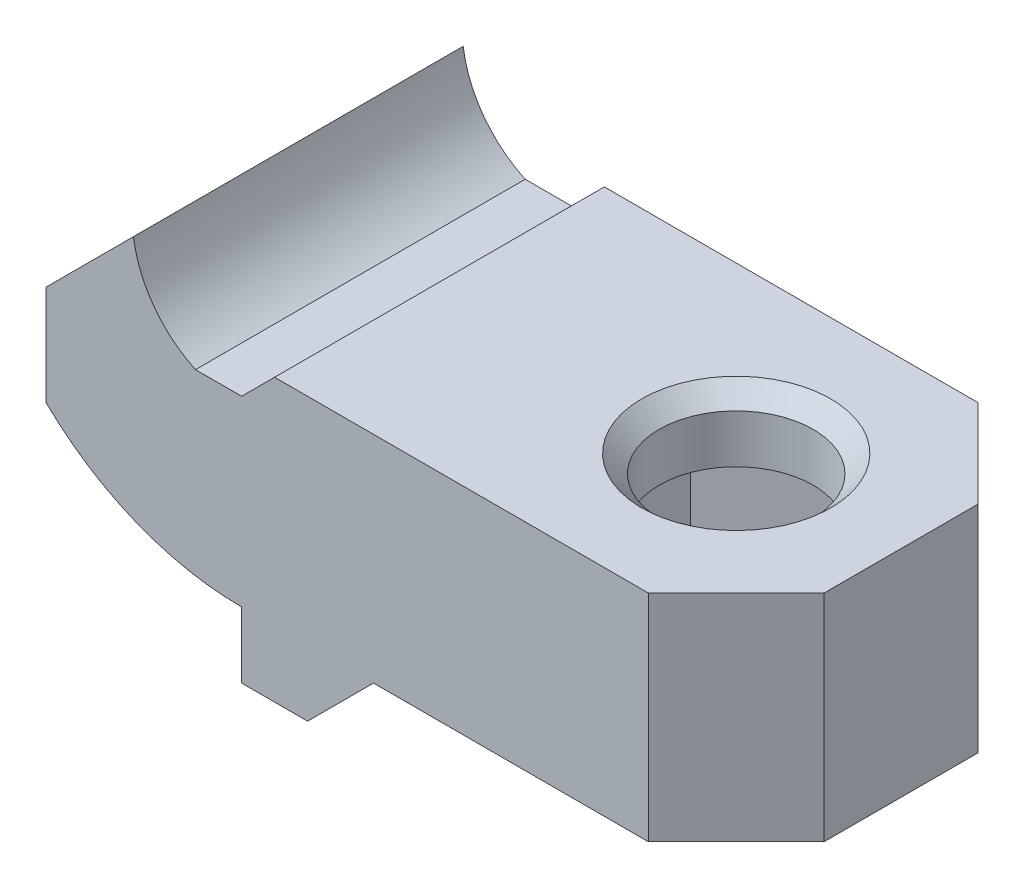
ISO-10303-21;
HEADER;
FILE_DESCRIPTION(('STEP AP214'),'2;1');
FILE_NAME('part.step','',(''),(''),'','','');
FILE_SCHEMA(('AUTOMOTIVE_DESIGN { 1 0 10303 214 1 1 1 1 }'));
ENDSEC;
DATA;
#1=APPLICATION_CONTEXT('core data for automotive mechanical design processes');
#2=APPLICATION_PROTOCOL_DEFINITION('international standard','automotive_design',2000,#1);
#3=PRODUCT_CONTEXT('',#1,'mechanical');
#4=PRODUCT('Part','Part','',(#3));
#5=PRODUCT_RELATED_PRODUCT_CATEGORY('part','',(#4));
#6=PRODUCT_DEFINITION_FORMATION('','',#4);
#7=PRODUCT_DEFINITION_CONTEXT('part definition',#1,'design');
#8=PRODUCT_DEFINITION('design','',#6,#7);
#9=PRODUCT_DEFINITION_SHAPE('','',#8);
#10=(LENGTH_UNIT() NAMED_UNIT(*) SI_UNIT(.MILLI.,.METRE.));
#11=(NAMED_UNIT(*) PLANE_ANGLE_UNIT() SI_UNIT($,.RADIAN.));
#12=(NAMED_UNIT(*) SI_UNIT($,.STERADIAN.) SOLID_ANGLE_UNIT());
#13=UNCERTAINTY_MEASURE_WITH_UNIT(LENGTH_MEASURE(1.E-05),#10,'distance_accuracy_value','');
#14=(GEOMETRIC_REPRESENTATION_CONTEXT(3) GLOBAL_UNCERTAINTY_ASSIGNED_CONTEXT((#13)) GLOBAL_UNIT_ASSIGNED_CONTEXT((#10,
#11,#12)) REPRESENTATION_CONTEXT('',''));
#15=CARTESIAN_POINT('',(0.,0.,0.));
#16=DIRECTION('',(0.,0.,1.));
#17=DIRECTION('',(1.,0.,0.));
#18=AXIS2_PLACEMENT_3D('',#15,#16,#17);
#19=CARTESIAN_POINT('',(-2.1,4.15,7.5));
#20=DIRECTION('',(0.,-1.,0.));
#21=DIRECTION('',(0.,0.,-1.));
#22=AXIS2_PLACEMENT_3D('',#19,#20,#21);
#23=PLANE('',#22);
#24=DIRECTION('',(-1.,0.,0.));
#25=VECTOR('',#24,1.);
#26=CARTESIAN_POINT('',(-2.1,4.15,-7.5));
#27=LINE('',#26,#25);
#28=CARTESIAN_POINT('',(0.,4.15,-7.5));
#29=VERTEX_POINT('',#28);
#30=CARTESIAN_POINT('',(-2.1,4.15,-7.5));
#31=VERTEX_POINT('',#30);
#32=EDGE_CURVE('E298',#29,#31,#27,.T.);
#33=ORIENTED_EDGE('',*,*,#32,.T.);
#34=DIRECTION('',(0.,0.,-1.));
#35=VECTOR('',#34,1.);
#36=CARTESIAN_POINT('',(-2.1,4.15,7.5));
#37=LINE('',#36,#35);
#38=CARTESIAN_POINT('',(-2.1,4.15,7.5));
#39=VERTEX_POINT('',#38);
#40=EDGE_CURVE('E344',#39,#31,#37,.T.);
#41=ORIENTED_EDGE('',*,*,#40,.F.);
#42=DIRECTION('',(-1.,0.,0.));
#43=VECTOR('',#42,1.);
#44=CARTESIAN_POINT('',(-2.1,4.15,7.5));
#45=LINE('',#44,#43);
#46=CARTESIAN_POINT('',(0.,4.15,7.5));
#47=VERTEX_POINT('',#46);
#48=EDGE_CURVE('E312',#47,#39,#45,.T.);
#49=ORIENTED_EDGE('',*,*,#48,.F.);
#50=DIRECTION('',(0.,0.,-1.));
#51=VECTOR('',#50,1.);
#52=CARTESIAN_POINT('',(0.,4.15,7.5));
#53=LINE('',#52,#51);
#54=EDGE_CURVE('E347',#47,#29,#53,.T.);
#55=ORIENTED_EDGE('',*,*,#54,.T.);
#56=EDGE_LOOP('',(#33,#41,#49,#55));
#57=FACE_BOUND('',#56,.T.);
#58=ADVANCED_FACE('F41',(#57),#23,.F.);
#59=CARTESIAN_POINT('',(0.,8.65,7.5));
#60=DIRECTION('',(0.,0.,-1.));
#61=DIRECTION('',(-1.,0.,0.));
#62=AXIS2_PLACEMENT_3D('',#59,#60,#61);
#63=CYLINDRICAL_SURFACE('',#62,4.96588360717405);
#64=CARTESIAN_POINT('',(0.,8.65,-7.5));
#65=DIRECTION('',(0.,0.,-1.));
#66=DIRECTION('',(-1.,0.,0.));
#67=AXIS2_PLACEMENT_3D('',#64,#65,#66);
#68=CIRCLE('',#67,4.96588360717405);
#69=CARTESIAN_POINT('',(-4.92042036194916,7.97957963805083,-7.5));
#70=VERTEX_POINT('',#69);
#71=EDGE_CURVE('E325',#31,#70,#68,.T.);
#72=ORIENTED_EDGE('',*,*,#71,.T.);
#73=DIRECTION('',(0.,0.,-1.));
#74=VECTOR('',#73,1.);
#75=CARTESIAN_POINT('',(-4.92042036194916,7.97957963805083,7.5));
#76=LINE('',#75,#74);
#77=CARTESIAN_POINT('',(-4.92042036194916,7.97957963805083,7.5));
#78=VERTEX_POINT('',#77);
#79=EDGE_CURVE('E341',#78,#70,#76,.T.);
#80=ORIENTED_EDGE('',*,*,#79,.F.);
#81=CARTESIAN_POINT('',(0.,8.65,7.5));
#82=DIRECTION('',(0.,0.,-1.));
#83=DIRECTION('',(-1.,0.,0.));
#84=AXIS2_PLACEMENT_3D('',#81,#82,#83);
#85=CIRCLE('',#84,4.96588360717405);
#86=EDGE_CURVE('E314',#39,#78,#85,.T.);
#87=ORIENTED_EDGE('',*,*,#86,.F.);
#88=ORIENTED_EDGE('',*,*,#40,.T.);
#89=EDGE_LOOP('',(#72,#80,#87,#88));
#90=FACE_BOUND('',#89,.T.);
#91=ADVANCED_FACE('F446',(#90),#63,.F.);
#92=CARTESIAN_POINT('',(-8.9,4.,7.5));
#93=DIRECTION('',(0.707106781186547,-0.707106781186548,0.));
#94=DIRECTION('',(0.707106781186548,0.707106781186547,0.));
#95=AXIS2_PLACEMENT_3D('',#92,#93,#94);
#96=PLANE('',#95);
#97=DIRECTION('',(-0.707106781186548,-0.707106781186547,0.));
#98=VECTOR('',#97,1.);
#99=CARTESIAN_POINT('',(-8.9,4.,-7.5));
#100=LINE('',#99,#98);
#101=CARTESIAN_POINT('',(-8.9,4.,-7.5));
#102=VERTEX_POINT('',#101);
#103=EDGE_CURVE('E327',#70,#102,#100,.T.);
#104=ORIENTED_EDGE('',*,*,#103,.T.);
#105=DIRECTION('',(0.,0.,-1.));
#106=VECTOR('',#105,1.);
#107=CARTESIAN_POINT('',(-8.9,4.,7.5));
#108=LINE('',#107,#106);
#109=CARTESIAN_POINT('',(-8.9,4.,7.5));
#110=VERTEX_POINT('',#109);
#111=EDGE_CURVE('E338',#110,#102,#108,.T.);
#112=ORIENTED_EDGE('',*,*,#111,.F.);
#113=DIRECTION('',(-0.707106781186548,-0.707106781186547,0.));
#114=VECTOR('',#113,1.);
#115=CARTESIAN_POINT('',(-8.9,4.,7.5));
#116=LINE('',#115,#114);
#117=EDGE_CURVE('E317',#78,#110,#116,.T.);
#118=ORIENTED_EDGE('',*,*,#117,.F.);
#119=ORIENTED_EDGE('',*,*,#79,.T.);
#120=EDGE_LOOP('',(#104,#112,#118,#119));
#121=FACE_BOUND('',#120,.T.);
#122=ADVANCED_FACE('F452',(#121),#96,.F.);
#123=CARTESIAN_POINT('',(-8.9,4.,7.5));
#124=DIRECTION('',(1.,0.,0.));
#125=DIRECTION('',(0.,0.,-1.));
#126=AXIS2_PLACEMENT_3D('',#123,#124,#125);
#127=PLANE('',#126);
#128=DIRECTION('',(0.,-1.,0.));
#129=VECTOR('',#128,1.);
#130=CARTESIAN_POINT('',(-8.9,4.,-7.5));
#131=LINE('',#130,#129);
#132=CARTESIAN_POINT('',(-8.9,-0.54945650568554,-7.5));
#133=VERTEX_POINT('',#132);
#134=EDGE_CURVE('E329',#102,#133,#131,.T.);
#135=ORIENTED_EDGE('',*,*,#134,.T.);
#136=DIRECTION('',(0.,0.,-1.));
#137=VECTOR('',#136,1.);
#138=CARTESIAN_POINT('',(-8.9,-0.54945650568554,7.5));
#139=LINE('',#138,#137);
#140=CARTESIAN_POINT('',(-8.9,-0.54945650568554,7.5));
#141=VERTEX_POINT('',#140);
#142=EDGE_CURVE('E335',#141,#133,#139,.T.);
#143=ORIENTED_EDGE('',*,*,#142,.F.);
#144=DIRECTION('',(0.,-1.,0.));
#145=VECTOR('',#144,1.);
#146=CARTESIAN_POINT('',(-8.9,4.,7.5));
#147=LINE('',#146,#145);
#148=EDGE_CURVE('E319',#110,#141,#147,.T.);
#149=ORIENTED_EDGE('',*,*,#148,.F.);
#150=ORIENTED_EDGE('',*,*,#111,.T.);
#151=EDGE_LOOP('',(#135,#143,#149,#150));
#152=FACE_BOUND('',#151,.T.);
#153=ADVANCED_FACE('F692',(#152),#127,.F.);
#154=CARTESIAN_POINT('',(0.,8.65,7.5));
#155=DIRECTION('',(0.,0.,-1.));
#156=DIRECTION('',(-1.,0.,0.));
#157=AXIS2_PLACEMENT_3D('',#154,#155,#156);
#158=CYLINDRICAL_SURFACE('',#157,12.8);
#159=CARTESIAN_POINT('',(0.,8.65,-7.5));
#160=DIRECTION('',(0.,0.,1.));
#161=DIRECTION('',(-1.,0.,0.));
#162=AXIS2_PLACEMENT_3D('',#159,#160,#161);
#163=CIRCLE('',#162,12.8);
#164=CARTESIAN_POINT('',(0.,-4.15,-7.5));
#165=VERTEX_POINT('',#164);
#166=EDGE_CURVE('E315',#133,#165,#163,.T.);
#167=ORIENTED_EDGE('',*,*,#166,.T.);
#168=DIRECTION('',(0.,0.,-1.));
#169=VECTOR('',#168,1.);
#170=CARTESIAN_POINT('',(0.,-4.15,7.5));
#171=LINE('',#170,#169);
#172=CARTESIAN_POINT('',(0.,-4.15,7.5));
#173=VERTEX_POINT('',#172);
#174=EDGE_CURVE('E323',#173,#165,#171,.T.);
#175=ORIENTED_EDGE('',*,*,#174,.F.);
#176=CARTESIAN_POINT('',(0.,8.65,7.5));
#177=DIRECTION('',(0.,0.,1.));
#178=DIRECTION('',(-1.,0.,0.));
#179=AXIS2_PLACEMENT_3D('',#176,#177,#178);
#180=CIRCLE('',#179,12.8);
#181=EDGE_CURVE('E321',#141,#173,#180,.T.);
#182=ORIENTED_EDGE('',*,*,#181,.F.);
#183=ORIENTED_EDGE('',*,*,#142,.T.);
#184=EDGE_LOOP('',(#167,#175,#182,#183));
#185=FACE_BOUND('',#184,.T.);
#186=ADVANCED_FACE('F686',(#185),#158,.T.);
#187=CARTESIAN_POINT('',(0.,8.65,7.5));
#188=DIRECTION('',(0.,0.,-1.));
#189=DIRECTION('',(-1.,0.,0.));
#190=AXIS2_PLACEMENT_3D('',#187,#188,#189);
#191=PLANE('',#190);
#192=DIRECTION('',(-1.,0.,0.));
#193=VECTOR('',#192,1.);
#194=CARTESIAN_POINT('',(5.99999999999999,-4.15,7.5));
#195=LINE('',#194,#193);
#196=CARTESIAN_POINT('',(18.5,-4.15,7.5));
#197=VERTEX_POINT('',#196);
#198=CARTESIAN_POINT('',(5.99999999999999,-4.15,7.5));
#199=VERTEX_POINT('',#198);
#200=EDGE_CURVE('E269',#197,#199,#195,.T.);
#201=ORIENTED_EDGE('',*,*,#200,.F.);
#202=DIRECTION('',(0.,1.,0.));
#203=VECTOR('',#202,1.);
#204=CARTESIAN_POINT('',(18.5,5.64999999998461,7.5));
#205=LINE('',#204,#203);
#206=CARTESIAN_POINT('',(18.5,5.64999999998461,7.5));
#207=VERTEX_POINT('',#206);
#208=EDGE_CURVE('E371',#197,#207,#205,.T.);
#209=ORIENTED_EDGE('',*,*,#208,.T.);
#210=DIRECTION('',(1.,0.,0.));
#211=VECTOR('',#210,1.);
#212=CARTESIAN_POINT('',(1.49999999998461,5.64999999998462,7.5));
#213=LINE('',#212,#211);
#214=CARTESIAN_POINT('',(1.49999999998461,5.64999999998462,7.5));
#215=VERTEX_POINT('',#214);
#216=EDGE_CURVE('E265',#215,#207,#213,.T.);
#217=ORIENTED_EDGE('',*,*,#216,.F.);
#218=DIRECTION('',(0.707106781186547,0.707106781186549,0.));
#219=VECTOR('',#218,1.);
#220=CARTESIAN_POINT('',(0.,4.15,7.5));
#221=LINE('',#220,#219);
#222=EDGE_CURVE('E260',#47,#215,#221,.T.);
#223=ORIENTED_EDGE('',*,*,#222,.F.);
#224=ORIENTED_EDGE('',*,*,#48,.T.);
#225=ORIENTED_EDGE('',*,*,#86,.T.);
#226=ORIENTED_EDGE('',*,*,#117,.T.);
#227=ORIENTED_EDGE('',*,*,#148,.T.);
#228=ORIENTED_EDGE('',*,*,#181,.T.);
#229=DIRECTION('',(0.,1.,0.));
#230=VECTOR('',#229,1.);
#231=CARTESIAN_POINT('',(0.,-4.15,7.5));
#232=LINE('',#231,#230);
#233=CARTESIAN_POINT('',(0.,-7.15,7.5));
#234=VERTEX_POINT('',#233);
#235=EDGE_CURVE('E257',#234,#173,#232,.T.);
#236=ORIENTED_EDGE('',*,*,#235,.F.);
#237=DIRECTION('',(-1.,0.,0.));
#238=VECTOR('',#237,1.);
#239=CARTESIAN_POINT('',(0.,-7.15,7.5));
#240=LINE('',#239,#238);
#241=CARTESIAN_POINT('',(3.,-7.15,7.5));
#242=VERTEX_POINT('',#241);
#243=EDGE_CURVE('E275',#242,#234,#240,.T.);
#244=ORIENTED_EDGE('',*,*,#243,.F.);
#245=DIRECTION('',(-0.707106781186546,-0.707106781186549,0.));
#246=VECTOR('',#245,1.);
#247=CARTESIAN_POINT('',(3.,-7.15,7.5));
#248=LINE('',#247,#246);
#249=EDGE_CURVE('E272',#199,#242,#248,.T.);
#250=ORIENTED_EDGE('',*,*,#249,.F.);
#251=EDGE_LOOP('',(#201,#209,#217,#223,#224,#225,#226,#227,#228,#236,#244,#250));
#252=FACE_BOUND('',#251,.T.);
#253=ADVANCED_FACE('F691',(#252),#191,.F.);
#254=CARTESIAN_POINT('',(0.,8.65,-7.5));
#255=DIRECTION('',(0.,0.,-1.));
#256=DIRECTION('',(-1.,0.,0.));
#257=AXIS2_PLACEMENT_3D('',#254,#255,#256);
#258=PLANE('',#257);
#259=DIRECTION('',(1.,0.,0.));
#260=VECTOR('',#259,1.);
#261=CARTESIAN_POINT('',(1.49999999998461,5.64999999998462,-7.5));
#262=LINE('',#261,#260);
#263=CARTESIAN_POINT('',(1.49999999998461,5.64999999998462,-7.5));
#264=VERTEX_POINT('',#263);
#265=CARTESIAN_POINT('',(18.5,5.64999999998461,-7.5));
#266=VERTEX_POINT('',#265);
#267=EDGE_CURVE('E282',#264,#266,#262,.T.);
#268=ORIENTED_EDGE('',*,*,#267,.T.);
#269=DIRECTION('',(0.,-1.,0.));
#270=VECTOR('',#269,1.);
#271=CARTESIAN_POINT('',(18.5,8.65,-7.5));
#272=LINE('',#271,#270);
#273=CARTESIAN_POINT('',(18.5,-4.15,-7.5));
#274=VERTEX_POINT('',#273);
#275=EDGE_CURVE('E351',#266,#274,#272,.T.);
#276=ORIENTED_EDGE('',*,*,#275,.T.);
#277=DIRECTION('',(-1.,0.,0.));
#278=VECTOR('',#277,1.);
#279=CARTESIAN_POINT('',(5.99999999999999,-4.15,-7.5));
#280=LINE('',#279,#278);
#281=CARTESIAN_POINT('',(5.99999999999999,-4.15,-7.5));
#282=VERTEX_POINT('',#281);
#283=EDGE_CURVE('E286',#274,#282,#280,.T.);
#284=ORIENTED_EDGE('',*,*,#283,.T.);
#285=DIRECTION('',(-0.707106781186546,-0.707106781186549,0.));
#286=VECTOR('',#285,1.);
#287=CARTESIAN_POINT('',(3.,-7.15,-7.5));
#288=LINE('',#287,#286);
#289=CARTESIAN_POINT('',(3.,-7.15,-7.5));
#290=VERTEX_POINT('',#289);
#291=EDGE_CURVE('E288',#282,#290,#288,.T.);
#292=ORIENTED_EDGE('',*,*,#291,.T.);
#293=DIRECTION('',(-1.,0.,0.));
#294=VECTOR('',#293,1.);
#295=CARTESIAN_POINT('',(0.,-7.15,-7.5));
#296=LINE('',#295,#294);
#297=CARTESIAN_POINT('',(0.,-7.15,-7.5));
#298=VERTEX_POINT('',#297);
#299=EDGE_CURVE('E291',#290,#298,#296,.T.);
#300=ORIENTED_EDGE('',*,*,#299,.T.);
#301=DIRECTION('',(0.,1.,0.));
#302=VECTOR('',#301,1.);
#303=CARTESIAN_POINT('',(0.,-4.15,-7.5));
#304=LINE('',#303,#302);
#305=EDGE_CURVE('E261',#298,#165,#304,.T.);
#306=ORIENTED_EDGE('',*,*,#305,.T.);
#307=ORIENTED_EDGE('',*,*,#166,.F.);
#308=ORIENTED_EDGE('',*,*,#134,.F.);
#309=ORIENTED_EDGE('',*,*,#103,.F.);
#310=ORIENTED_EDGE('',*,*,#71,.F.);
#311=ORIENTED_EDGE('',*,*,#32,.F.);
#312=DIRECTION('',(0.707106781186547,0.707106781186549,0.));
#313=VECTOR('',#312,1.);
#314=CARTESIAN_POINT('',(0.,4.15,-7.5));
#315=LINE('',#314,#313);
#316=EDGE_CURVE('E279',#29,#264,#315,.T.);
#317=ORIENTED_EDGE('',*,*,#316,.T.);
#318=EDGE_LOOP('',(#268,#276,#284,#292,#300,#306,#307,#308,#309,#310,#311,#317));
#319=FACE_BOUND('',#318,.T.);
#320=ADVANCED_FACE('F676',(#319),#258,.T.);
#321=CARTESIAN_POINT('',(0.,-4.15,7.5));
#322=DIRECTION('',(-1.,0.,0.));
#323=DIRECTION('',(0.,-1.,0.));
#324=AXIS2_PLACEMENT_3D('',#321,#322,#323);
#325=PLANE('',#324);
#326=ORIENTED_EDGE('',*,*,#235,.T.);
#327=ORIENTED_EDGE('',*,*,#174,.T.);
#328=ORIENTED_EDGE('',*,*,#305,.F.);
#329=DIRECTION('',(0.,0.,-1.));
#330=VECTOR('',#329,1.);
#331=CARTESIAN_POINT('',(0.,-7.15,7.5));
#332=LINE('',#331,#330);
#333=EDGE_CURVE('E296',#234,#298,#332,.T.);
#334=ORIENTED_EDGE('',*,*,#333,.F.);
#335=EDGE_LOOP('',(#326,#327,#328,#334));
#336=FACE_BOUND('',#335,.T.);
#337=ADVANCED_FACE('F667',(#336),#325,.T.);
#338=CARTESIAN_POINT('',(0.,-7.15,7.5));
#339=DIRECTION('',(0.,-1.,0.));
#340=DIRECTION('',(0.,0.,-1.));
#341=AXIS2_PLACEMENT_3D('',#338,#339,#340);
#342=PLANE('',#341);
#343=ORIENTED_EDGE('',*,*,#299,.F.);
#344=DIRECTION('',(0.,0.,-1.));
#345=VECTOR('',#344,1.);
#346=CARTESIAN_POINT('',(3.,-7.15,7.5));
#347=LINE('',#346,#345);
#348=EDGE_CURVE('E299',#242,#290,#347,.T.);
#349=ORIENTED_EDGE('',*,*,#348,.F.);
#350=ORIENTED_EDGE('',*,*,#243,.T.);
#351=ORIENTED_EDGE('',*,*,#333,.T.);
#352=EDGE_LOOP('',(#343,#349,#350,#351));
#353=FACE_BOUND('',#352,.T.);
#354=ADVANCED_FACE('F658',(#353),#342,.T.);
#355=CARTESIAN_POINT('',(3.,-7.15,7.5));
#356=DIRECTION('',(0.707106781186549,-0.707106781186546,0.));
#357=DIRECTION('',(0.707106781186546,0.707106781186549,0.));
#358=AXIS2_PLACEMENT_3D('',#355,#356,#357);
#359=PLANE('',#358);
#360=ORIENTED_EDGE('',*,*,#291,.F.);
#361=DIRECTION('',(0.,0.,-1.));
#362=VECTOR('',#361,1.);
#363=CARTESIAN_POINT('',(5.99999999999999,-4.15,7.5));
#364=LINE('',#363,#362);
#365=EDGE_CURVE('E301',#199,#282,#364,.T.);
#366=ORIENTED_EDGE('',*,*,#365,.F.);
#367=ORIENTED_EDGE('',*,*,#249,.T.);
#368=ORIENTED_EDGE('',*,*,#348,.T.);
#369=EDGE_LOOP('',(#360,#366,#367,#368));
#370=FACE_BOUND('',#369,.T.);
#371=ADVANCED_FACE('F649',(#370),#359,.T.);
#372=CARTESIAN_POINT('',(5.99999999999999,-4.15,7.5));
#373=DIRECTION('',(0.,-1.,0.));
#374=DIRECTION('',(1.,0.,0.));
#375=AXIS2_PLACEMENT_3D('',#372,#373,#374);
#376=PLANE('',#375);
#377=DIRECTION('',(-0.866025403784439,0.,-0.5));
#378=VECTOR('',#377,1.);
#379=CARTESIAN_POINT('',(15.4,-4.15,-6.35085296108589));
#380=LINE('',#379,#378);
#381=CARTESIAN_POINT('',(20.7,-4.15,-3.29089653438088));
#382=VERTEX_POINT('',#381);
#383=CARTESIAN_POINT('',(15.,-4.15,-6.58179306876174));
#384=VERTEX_POINT('',#383);
#385=EDGE_CURVE('E384',#382,#384,#380,.T.);
#386=ORIENTED_EDGE('',*,*,#385,.T.);
#387=DIRECTION('',(-0.866025403784439,0.,0.5));
#388=VECTOR('',#387,1.);
#389=CARTESIAN_POINT('',(9.7,-4.15,-3.52183664205672));
#390=LINE('',#389,#388);
#391=CARTESIAN_POINT('',(9.29999999999999,-4.15,-3.29089653438087));
#392=VERTEX_POINT('',#391);
#393=EDGE_CURVE('E386',#384,#392,#390,.T.);
#394=ORIENTED_EDGE('',*,*,#393,.T.);
#395=DIRECTION('',(0.,0.,1.));
#396=VECTOR('',#395,1.);
#397=CARTESIAN_POINT('',(9.3,-4.15,2.82901631902917));
#398=LINE('',#397,#396);
#399=CARTESIAN_POINT('',(9.3,-4.15,3.29089653438087));
#400=VERTEX_POINT('',#399);
#401=EDGE_CURVE('E375',#392,#400,#398,.T.);
#402=ORIENTED_EDGE('',*,*,#401,.T.);
#403=DIRECTION('',(0.866025403784439,0.,0.5));
#404=VECTOR('',#403,1.);
#405=CARTESIAN_POINT('',(14.6,-4.15,6.35085296108588));
#406=LINE('',#405,#404);
#407=CARTESIAN_POINT('',(15.,-4.15,6.58179306876173));
#408=VERTEX_POINT('',#407);
#409=EDGE_CURVE('E377',#400,#408,#406,.T.);
#410=ORIENTED_EDGE('',*,*,#409,.T.);
#411=DIRECTION('',(0.866025403784439,0.,-0.5));
#412=VECTOR('',#411,1.);
#413=CARTESIAN_POINT('',(20.3,-4.15,3.52183664205672));
#414=LINE('',#413,#412);
#415=CARTESIAN_POINT('',(20.7,-4.15,3.29089653438087));
#416=VERTEX_POINT('',#415);
#417=EDGE_CURVE('E380',#408,#416,#414,.T.);
#418=ORIENTED_EDGE('',*,*,#417,.T.);
#419=DIRECTION('',(0.,0.,-1.));
#420=VECTOR('',#419,1.);
#421=CARTESIAN_POINT('',(20.7,-4.15,-2.82901631902917));
#422=LINE('',#421,#420);
#423=EDGE_CURVE('E382',#416,#382,#422,.T.);
#424=ORIENTED_EDGE('',*,*,#423,.T.);
#425=EDGE_LOOP('',(#386,#394,#402,#410,#418,#424));
#426=FACE_BOUND('',#425,.T.);
#427=ORIENTED_EDGE('',*,*,#283,.F.);
#428=DIRECTION('',(-0.707106781186546,0.,-0.707106781186549));
#429=VECTOR('',#428,1.);
#430=CARTESIAN_POINT('',(19.75,-4.15,-6.24999999999998));
#431=LINE('',#430,#429);
#432=CARTESIAN_POINT('',(22.5,-4.15,-3.49999999999999));
#433=VERTEX_POINT('',#432);
#434=EDGE_CURVE('E359',#274,#433,#431,.F.);
#435=ORIENTED_EDGE('',*,*,#434,.T.);
#436=DIRECTION('',(0.,0.,-1.));
#437=VECTOR('',#436,1.);
#438=CARTESIAN_POINT('',(22.5,-4.15,7.5));
#439=LINE('',#438,#437);
#440=CARTESIAN_POINT('',(22.5,-4.15,3.5));
#441=VERTEX_POINT('',#440);
#442=EDGE_CURVE('E304',#441,#433,#439,.T.);
#443=ORIENTED_EDGE('',*,*,#442,.F.);
#444=DIRECTION('',(-0.707106781186548,0.,0.707106781186547));
#445=VECTOR('',#444,1.);
#446=CARTESIAN_POINT('',(12.25,-4.15,13.75));
#447=LINE('',#446,#445);
#448=EDGE_CURVE('E357',#441,#197,#447,.T.);
#449=ORIENTED_EDGE('',*,*,#448,.T.);
#450=ORIENTED_EDGE('',*,*,#200,.T.);
#451=ORIENTED_EDGE('',*,*,#365,.T.);
#452=EDGE_LOOP('',(#427,#435,#443,#449,#450,#451));
#453=FACE_BOUND('',#452,.T.);
#454=ADVANCED_FACE('F640',(#426,#453),#376,.T.);
#455=CARTESIAN_POINT('',(22.5,5.64999999998461,7.5));
#456=DIRECTION('',(1.,0.,0.));
#457=DIRECTION('',(0.,0.,-1.));
#458=AXIS2_PLACEMENT_3D('',#455,#456,#457);
#459=PLANE('',#458);
#460=ORIENTED_EDGE('',*,*,#442,.T.);
#461=DIRECTION('',(0.,1.,0.));
#462=VECTOR('',#461,1.);
#463=CARTESIAN_POINT('',(22.5,5.64999999998461,-3.49999999999999));
#464=LINE('',#463,#462);
#465=CARTESIAN_POINT('',(22.5,5.64999999998461,-3.49999999999999));
#466=VERTEX_POINT('',#465);
#467=EDGE_CURVE('E364',#433,#466,#464,.T.);
#468=ORIENTED_EDGE('',*,*,#467,.T.);
#469=DIRECTION('',(0.,0.,-1.));
#470=VECTOR('',#469,1.);
#471=CARTESIAN_POINT('',(22.5,5.64999999998461,7.5));
#472=LINE('',#471,#470);
#473=CARTESIAN_POINT('',(22.5,5.64999999998461,3.5));
#474=VERTEX_POINT('',#473);
#475=EDGE_CURVE('E307',#474,#466,#472,.T.);
#476=ORIENTED_EDGE('',*,*,#475,.F.);
#477=DIRECTION('',(0.,-1.,0.));
#478=VECTOR('',#477,1.);
#479=CARTESIAN_POINT('',(22.5,-4.15,3.5));
#480=LINE('',#479,#478);
#481=EDGE_CURVE('E361',#474,#441,#480,.T.);
#482=ORIENTED_EDGE('',*,*,#481,.T.);
#483=EDGE_LOOP('',(#460,#468,#476,#482));
#484=FACE_BOUND('',#483,.T.);
#485=ADVANCED_FACE('F631',(#484),#459,.T.);
#486=CARTESIAN_POINT('',(1.49999999998461,5.64999999998462,7.5));
#487=DIRECTION('',(0.,1.,0.));
#488=DIRECTION('',(-1.,0.,0.));
#489=AXIS2_PLACEMENT_3D('',#486,#487,#488);
#490=PLANE('',#489);
#491=CARTESIAN_POINT('',(15.,5.64999999998461,0.));
#492=DIRECTION('',(0.,1.,0.));
#493=DIRECTION('',(-1.,0.,0.));
#494=AXIS2_PLACEMENT_3D('',#491,#492,#493);
#495=CIRCLE('',#494,4.30000000000002);
#496=CARTESIAN_POINT('',(10.7,5.64999999998461,0.));
#497=VERTEX_POINT('',#496);
#498=EDGE_CURVE('E11',#497,#497,#495,.F.);
#499=ORIENTED_EDGE('',*,*,#498,.T.);
#500=EDGE_LOOP('',(#499));
#501=FACE_BOUND('',#500,.T.);
#502=ORIENTED_EDGE('',*,*,#475,.T.);
#503=DIRECTION('',(0.707106781186546,0.,0.707106781186549));
#504=VECTOR('',#503,1.);
#505=CARTESIAN_POINT('',(17.4999999999923,5.64999999998461,-8.50000000000767));
#506=LINE('',#505,#504);
#507=EDGE_CURVE('E369',#466,#266,#506,.F.);
#508=ORIENTED_EDGE('',*,*,#507,.T.);
#509=ORIENTED_EDGE('',*,*,#267,.F.);
#510=DIRECTION('',(0.,0.,-1.));
#511=VECTOR('',#510,1.);
#512=CARTESIAN_POINT('',(1.49999999998461,5.64999999998462,7.5));
#513=LINE('',#512,#511);
#514=EDGE_CURVE('E278',#215,#264,#513,.T.);
#515=ORIENTED_EDGE('',*,*,#514,.F.);
#516=ORIENTED_EDGE('',*,*,#216,.T.);
#517=DIRECTION('',(0.707106781186548,0.,-0.707106781186547));
#518=VECTOR('',#517,1.);
#519=CARTESIAN_POINT('',(9.99999999999228,5.64999999998461,16.0000000000077));
#520=LINE('',#519,#518);
#521=EDGE_CURVE('E366',#207,#474,#520,.T.);
#522=ORIENTED_EDGE('',*,*,#521,.T.);
#523=EDGE_LOOP('',(#502,#508,#509,#515,#516,#522));
#524=FACE_BOUND('',#523,.T.);
#525=ADVANCED_FACE('F622',(#501,#524),#490,.T.);
#526=CARTESIAN_POINT('',(0.,4.15,7.5));
#527=DIRECTION('',(-0.707106781186549,0.707106781186547,0.));
#528=DIRECTION('',(-0.707106781186547,-0.707106781186549,0.));
#529=AXIS2_PLACEMENT_3D('',#526,#527,#528);
#530=PLANE('',#529);
#531=ORIENTED_EDGE('',*,*,#316,.F.);
#532=ORIENTED_EDGE('',*,*,#54,.F.);
#533=ORIENTED_EDGE('',*,*,#222,.T.);
#534=ORIENTED_EDGE('',*,*,#514,.T.);
#535=EDGE_LOOP('',(#531,#532,#533,#534));
#536=FACE_BOUND('',#535,.T.);
#537=ADVANCED_FACE('F612',(#536),#530,.T.);
#538=CARTESIAN_POINT('',(15.,-7.15,0.));
#539=DIRECTION('',(0.,1.,0.));
#540=DIRECTION('',(-1.,0.,0.));
#541=AXIS2_PLACEMENT_3D('',#538,#539,#540);
#542=CYLINDRICAL_SURFACE('',#541,3.5);
#543=CARTESIAN_POINT('',(15.,4.84999999998459,0.));
#544=DIRECTION('',(0.,1.,0.));
#545=DIRECTION('',(0.,0.,1.));
#546=AXIS2_PLACEMENT_3D('',#543,#544,#545);
#547=CIRCLE('',#546,3.5);
#548=CARTESIAN_POINT('',(15.,4.84999999998459,3.5));
#549=VERTEX_POINT('',#548);
#550=EDGE_CURVE('E52',#549,#549,#547,.T.);
#551=ORIENTED_EDGE('',*,*,#550,.T.);
#552=EDGE_LOOP('',(#551));
#553=FACE_BOUND('',#552,.T.);
#554=CARTESIAN_POINT('',(15.,2.64999999998461,0.));
#555=DIRECTION('',(0.,1.,0.));
#556=DIRECTION('',(-1.,0.,0.));
#557=AXIS2_PLACEMENT_3D('',#554,#555,#556);
#558=CIRCLE('',#557,3.5);
#559=CARTESIAN_POINT('',(11.5,2.64999999998461,0.));
#560=VERTEX_POINT('',#559);
#561=EDGE_CURVE('E248',#560,#560,#558,.F.);
#562=ORIENTED_EDGE('',*,*,#561,.T.);
#563=EDGE_LOOP('',(#562));
#564=FACE_BOUND('',#563,.T.);
#565=ADVANCED_FACE('F604',(#553,#564),#542,.F.);
#566=CARTESIAN_POINT('',(0.,2.64999999998462,0.));
#567=DIRECTION('',(0.,1.,0.));
#568=DIRECTION('',(-1.,0.,0.));
#569=AXIS2_PLACEMENT_3D('',#566,#567,#568);
#570=PLANE('',#569);
#571=DIRECTION('',(-0.866025403784439,0.,-0.5));
#572=VECTOR('',#571,1.);
#573=CARTESIAN_POINT('',(19.9,2.64999999998461,-2.82901631902917));
#574=LINE('',#573,#572);
#575=CARTESIAN_POINT('',(19.9,2.64999999998461,-2.82901631902917));
#576=VERTEX_POINT('',#575);
#577=CARTESIAN_POINT('',(15.,2.64999999998461,-5.65803263805833));
#578=VERTEX_POINT('',#577);
#579=EDGE_CURVE('E222',#576,#578,#574,.T.);
#580=ORIENTED_EDGE('',*,*,#579,.F.);
#581=DIRECTION('',(0.,0.,-1.));
#582=VECTOR('',#581,1.);
#583=CARTESIAN_POINT('',(19.9,2.64999999998461,2.82901631902916));
#584=LINE('',#583,#582);
#585=CARTESIAN_POINT('',(19.9,2.64999999998461,2.82901631902916));
#586=VERTEX_POINT('',#585);
#587=EDGE_CURVE('E214',#586,#576,#584,.T.);
#588=ORIENTED_EDGE('',*,*,#587,.F.);
#589=DIRECTION('',(0.866025403784439,0.,-0.5));
#590=VECTOR('',#589,1.);
#591=CARTESIAN_POINT('',(15.,2.64999999998461,5.65803263805833));
#592=LINE('',#591,#590);
#593=CARTESIAN_POINT('',(15.,2.64999999998461,5.65803263805833));
#594=VERTEX_POINT('',#593);
#595=EDGE_CURVE('E241',#594,#586,#592,.T.);
#596=ORIENTED_EDGE('',*,*,#595,.F.);
#597=DIRECTION('',(0.866025403784439,0.,0.5));
#598=VECTOR('',#597,1.);
#599=CARTESIAN_POINT('',(10.1,2.64999999998461,2.82901631902917));
#600=LINE('',#599,#598);
#601=CARTESIAN_POINT('',(10.1,2.64999999998461,2.82901631902917));
#602=VERTEX_POINT('',#601);
#603=EDGE_CURVE('E237',#602,#594,#600,.T.);
#604=ORIENTED_EDGE('',*,*,#603,.F.);
#605=DIRECTION('',(0.,0.,1.));
#606=VECTOR('',#605,1.);
#607=CARTESIAN_POINT('',(10.1,2.64999999998461,-2.82901631902917));
#608=LINE('',#607,#606);
#609=CARTESIAN_POINT('',(10.1,2.64999999998461,-2.82901631902917));
#610=VERTEX_POINT('',#609);
#611=EDGE_CURVE('E226',#610,#602,#608,.T.);
#612=ORIENTED_EDGE('',*,*,#611,.F.);
#613=DIRECTION('',(-0.866025403784439,0.,0.5));
#614=VECTOR('',#613,1.);
#615=CARTESIAN_POINT('',(15.,2.64999999998461,-5.65803263805833));
#616=LINE('',#615,#614);
#617=EDGE_CURVE('E208',#578,#610,#616,.T.);
#618=ORIENTED_EDGE('',*,*,#617,.F.);
#619=EDGE_LOOP('',(#580,#588,#596,#604,#612,#618));
#620=FACE_BOUND('',#619,.T.);
#621=ORIENTED_EDGE('',*,*,#561,.F.);
#622=EDGE_LOOP('',(#621));
#623=FACE_BOUND('',#622,.T.);
#624=ADVANCED_FACE('F219',(#620,#623),#570,.F.);
#625=CARTESIAN_POINT('',(19.9,-7.35000000001539,-2.82901631902917));
#626=DIRECTION('',(0.5,0.,-0.866025403784439));
#627=DIRECTION('',(-0.866025403784439,0.,-0.5));
#628=AXIS2_PLACEMENT_3D('',#625,#626,#627);
#629=PLANE('',#628);
#630=DIRECTION('',(0.,1.,0.));
#631=VECTOR('',#630,1.);
#632=CARTESIAN_POINT('',(15.,-7.35000000001539,-5.65803263805833));
#633=LINE('',#632,#631);
#634=CARTESIAN_POINT('',(15.,-3.35,-5.65803263805833));
#635=VERTEX_POINT('',#634);
#636=EDGE_CURVE('E204',#635,#578,#633,.T.);
#637=ORIENTED_EDGE('',*,*,#636,.F.);
#638=DIRECTION('',(0.866025403784439,0.,0.5));
#639=VECTOR('',#638,1.);
#640=CARTESIAN_POINT('',(19.9,-3.35000000000001,-2.82901631902917));
#641=LINE('',#640,#639);
#642=CARTESIAN_POINT('',(19.9,-3.35000000000001,-2.82901631902917));
#643=VERTEX_POINT('',#642);
#644=EDGE_CURVE('E389',#635,#643,#641,.T.);
#645=ORIENTED_EDGE('',*,*,#644,.T.);
#646=DIRECTION('',(0.,1.,0.));
#647=VECTOR('',#646,1.);
#648=CARTESIAN_POINT('',(19.9,-7.35000000001539,-2.82901631902917));
#649=LINE('',#648,#647);
#650=EDGE_CURVE('E231',#643,#576,#649,.T.);
#651=ORIENTED_EDGE('',*,*,#650,.T.);
#652=ORIENTED_EDGE('',*,*,#579,.T.);
#653=EDGE_LOOP('',(#637,#645,#651,#652));
#654=FACE_BOUND('',#653,.T.);
#655=ADVANCED_FACE('F229',(#654),#629,.F.);
#656=CARTESIAN_POINT('',(19.9,-7.35000000001539,2.82901631902916));
#657=DIRECTION('',(1.,0.,0.));
#658=DIRECTION('',(0.,0.,-1.));
#659=AXIS2_PLACEMENT_3D('',#656,#657,#658);
#660=PLANE('',#659);
#661=ORIENTED_EDGE('',*,*,#650,.F.);
#662=DIRECTION('',(0.,0.,1.));
#663=VECTOR('',#662,1.);
#664=CARTESIAN_POINT('',(19.9,-3.35000000000001,2.82901631902916));
#665=LINE('',#664,#663);
#666=CARTESIAN_POINT('',(19.9,-3.35000000000001,2.82901631902916));
#667=VERTEX_POINT('',#666);
#668=EDGE_CURVE('E391',#643,#667,#665,.T.);
#669=ORIENTED_EDGE('',*,*,#668,.T.);
#670=DIRECTION('',(0.,1.,0.));
#671=VECTOR('',#670,1.);
#672=CARTESIAN_POINT('',(19.9,-7.35000000001539,2.82901631902916));
#673=LINE('',#672,#671);
#674=EDGE_CURVE('E249',#667,#586,#673,.T.);
#675=ORIENTED_EDGE('',*,*,#674,.T.);
#676=ORIENTED_EDGE('',*,*,#587,.T.);
#677=EDGE_LOOP('',(#661,#669,#675,#676));
#678=FACE_BOUND('',#677,.T.);
#679=ADVANCED_FACE('F435',(#678),#660,.F.);
#680=CARTESIAN_POINT('',(15.,-7.35000000001539,5.65803263805833));
#681=DIRECTION('',(0.5,0.,0.866025403784439));
#682=DIRECTION('',(0.866025403784439,0.,-0.5));
#683=AXIS2_PLACEMENT_3D('',#680,#681,#682);
#684=PLANE('',#683);
#685=ORIENTED_EDGE('',*,*,#674,.F.);
#686=DIRECTION('',(-0.866025403784439,0.,0.5));
#687=VECTOR('',#686,1.);
#688=CARTESIAN_POINT('',(15.,-3.35,5.65803263805833));
#689=LINE('',#688,#687);
#690=CARTESIAN_POINT('',(15.,-3.35,5.65803263805833));
#691=VERTEX_POINT('',#690);
#692=EDGE_CURVE('E68',#667,#691,#689,.T.);
#693=ORIENTED_EDGE('',*,*,#692,.T.);
#694=DIRECTION('',(0.,1.,0.));
#695=VECTOR('',#694,1.);
#696=CARTESIAN_POINT('',(15.,-7.35000000001539,5.65803263805833));
#697=LINE('',#696,#695);
#698=EDGE_CURVE('E252',#691,#594,#697,.T.);
#699=ORIENTED_EDGE('',*,*,#698,.T.);
#700=ORIENTED_EDGE('',*,*,#595,.T.);
#701=EDGE_LOOP('',(#685,#693,#699,#700));
#702=FACE_BOUND('',#701,.T.);
#703=ADVANCED_FACE('F433',(#702),#684,.F.);
#704=CARTESIAN_POINT('',(10.1,-7.35000000001539,2.82901631902917));
#705=DIRECTION('',(-0.5,0.,0.866025403784439));
#706=DIRECTION('',(0.866025403784439,0.,0.5));
#707=AXIS2_PLACEMENT_3D('',#704,#705,#706);
#708=PLANE('',#707);
#709=ORIENTED_EDGE('',*,*,#698,.F.);
#710=DIRECTION('',(-0.866025403784439,0.,-0.5));
#711=VECTOR('',#710,1.);
#712=CARTESIAN_POINT('',(10.1,-3.35,2.82901631902917));
#713=LINE('',#712,#711);
#714=CARTESIAN_POINT('',(10.1,-3.35,2.82901631902917));
#715=VERTEX_POINT('',#714);
#716=EDGE_CURVE('E60',#691,#715,#713,.T.);
#717=ORIENTED_EDGE('',*,*,#716,.T.);
#718=DIRECTION('',(0.,1.,0.));
#719=VECTOR('',#718,1.);
#720=CARTESIAN_POINT('',(10.1,-7.35000000001539,2.82901631902917));
#721=LINE('',#720,#719);
#722=EDGE_CURVE('E254',#715,#602,#721,.T.);
#723=ORIENTED_EDGE('',*,*,#722,.T.);
#724=ORIENTED_EDGE('',*,*,#603,.T.);
#725=EDGE_LOOP('',(#709,#717,#723,#724));
#726=FACE_BOUND('',#725,.T.);
#727=ADVANCED_FACE('F431',(#726),#708,.F.);
#728=CARTESIAN_POINT('',(10.1,-7.35000000001539,-2.82901631902917));
#729=DIRECTION('',(-1.,0.,0.));
#730=DIRECTION('',(0.,0.,1.));
#731=AXIS2_PLACEMENT_3D('',#728,#729,#730);
#732=PLANE('',#731);
#733=ORIENTED_EDGE('',*,*,#722,.F.);
#734=DIRECTION('',(0.,0.,-1.));
#735=VECTOR('',#734,1.);
#736=CARTESIAN_POINT('',(10.1,-3.35,-2.82901631902916));
#737=LINE('',#736,#735);
#738=CARTESIAN_POINT('',(10.1,-3.35,-2.82901631902917));
#739=VERTEX_POINT('',#738);
#740=EDGE_CURVE('E395',#715,#739,#737,.T.);
#741=ORIENTED_EDGE('',*,*,#740,.T.);
#742=DIRECTION('',(0.,1.,0.));
#743=VECTOR('',#742,1.);
#744=CARTESIAN_POINT('',(10.1,-7.35000000001539,-2.82901631902917));
#745=LINE('',#744,#743);
#746=EDGE_CURVE('E213',#739,#610,#745,.T.);
#747=ORIENTED_EDGE('',*,*,#746,.T.);
#748=ORIENTED_EDGE('',*,*,#611,.T.);
#749=EDGE_LOOP('',(#733,#741,#747,#748));
#750=FACE_BOUND('',#749,.T.);
#751=ADVANCED_FACE('F430',(#750),#732,.F.);
#752=CARTESIAN_POINT('',(15.,-7.35000000001539,-5.65803263805833));
#753=DIRECTION('',(-0.5,0.,-0.866025403784439));
#754=DIRECTION('',(-0.866025403784439,0.,0.5));
#755=AXIS2_PLACEMENT_3D('',#752,#753,#754);
#756=PLANE('',#755);
#757=ORIENTED_EDGE('',*,*,#746,.F.);
#758=DIRECTION('',(0.866025403784439,0.,-0.5));
#759=VECTOR('',#758,1.);
#760=CARTESIAN_POINT('',(15.,-3.35,-5.65803263805833));
#761=LINE('',#760,#759);
#762=EDGE_CURVE('E210',#739,#635,#761,.T.);
#763=ORIENTED_EDGE('',*,*,#762,.T.);
#764=ORIENTED_EDGE('',*,*,#636,.T.);
#765=ORIENTED_EDGE('',*,*,#617,.T.);
#766=EDGE_LOOP('',(#757,#763,#764,#765));
#767=FACE_BOUND('',#766,.T.);
#768=ADVANCED_FACE('F207',(#767),#756,.F.);
#769=CARTESIAN_POINT('',(18.5,8.65,-7.5));
#770=DIRECTION('',(-0.707106781186549,0.,0.707106781186546));
#771=DIRECTION('',(0.,-1.,0.));
#772=AXIS2_PLACEMENT_3D('',#769,#770,#771);
#773=PLANE('',#772);
#774=ORIENTED_EDGE('',*,*,#507,.F.);
#775=ORIENTED_EDGE('',*,*,#467,.F.);
#776=ORIENTED_EDGE('',*,*,#434,.F.);
#777=ORIENTED_EDGE('',*,*,#275,.F.);
#778=EDGE_LOOP('',(#774,#775,#776,#777));
#779=FACE_BOUND('',#778,.T.);
#780=ADVANCED_FACE('F458',(#779),#773,.F.);
#781=CARTESIAN_POINT('',(22.5,5.64999999998461,3.5));
#782=DIRECTION('',(0.707106781186547,0.,0.707106781186548));
#783=DIRECTION('',(0.,1.,0.));
#784=AXIS2_PLACEMENT_3D('',#781,#782,#783);
#785=PLANE('',#784);
#786=ORIENTED_EDGE('',*,*,#521,.F.);
#787=ORIENTED_EDGE('',*,*,#208,.F.);
#788=ORIENTED_EDGE('',*,*,#448,.F.);
#789=ORIENTED_EDGE('',*,*,#481,.F.);
#790=EDGE_LOOP('',(#786,#787,#788,#789));
#791=FACE_BOUND('',#790,.T.);
#792=ADVANCED_FACE('F464',(#791),#785,.T.);
#793=CARTESIAN_POINT('',(15.,-3.35,5.65803263805833));
#794=DIRECTION('',(-0.353553390593273,-0.707106781186549,-0.612372435695793));
#795=DIRECTION('',(0.866025403784439,0.,-0.5));
#796=AXIS2_PLACEMENT_3D('',#793,#794,#795);
#797=PLANE('',#796);
#798=DIRECTION('',(0.654653670707978,-0.654653670707975,0.377964473009229));
#799=VECTOR('',#798,1.);
#800=CARTESIAN_POINT('',(19.9,-3.35,2.82901631902916));
#801=LINE('',#800,#799);
#802=EDGE_CURVE('E234',#416,#667,#801,.F.);
#803=ORIENTED_EDGE('',*,*,#802,.F.);
#804=ORIENTED_EDGE('',*,*,#417,.F.);
#805=DIRECTION('',(0.,-0.654653670707975,0.755928946018456));
#806=VECTOR('',#805,1.);
#807=CARTESIAN_POINT('',(15.,-3.35,5.65803263805833));
#808=LINE('',#807,#806);
#809=EDGE_CURVE('E46',#691,#408,#808,.T.);
#810=ORIENTED_EDGE('',*,*,#809,.F.);
#811=ORIENTED_EDGE('',*,*,#692,.F.);
#812=EDGE_LOOP('',(#803,#804,#810,#811));
#813=FACE_BOUND('',#812,.T.);
#814=ADVANCED_FACE('F418',(#813),#797,.T.);
#815=CARTESIAN_POINT('',(10.1,-3.35,2.82901631902917));
#816=DIRECTION('',(0.353553390593273,-0.707106781186549,-0.612372435695793));
#817=DIRECTION('',(0.866025403784439,0.,0.5));
#818=AXIS2_PLACEMENT_3D('',#815,#816,#817);
#819=PLANE('',#818);
#820=ORIENTED_EDGE('',*,*,#809,.T.);
#821=ORIENTED_EDGE('',*,*,#409,.F.);
#822=DIRECTION('',(-0.654653670707978,-0.654653670707976,0.377964473009228));
#823=VECTOR('',#822,1.);
#824=CARTESIAN_POINT('',(10.1,-3.35,2.82901631902917));
#825=LINE('',#824,#823);
#826=EDGE_CURVE('E407',#715,#400,#825,.T.);
#827=ORIENTED_EDGE('',*,*,#826,.F.);
#828=ORIENTED_EDGE('',*,*,#716,.F.);
#829=EDGE_LOOP('',(#820,#821,#827,#828));
#830=FACE_BOUND('',#829,.T.);
#831=ADVANCED_FACE('F423',(#830),#819,.T.);
#832=CARTESIAN_POINT('',(19.9,-3.35,2.82901631902916));
#833=DIRECTION('',(-0.707106781186546,-0.707106781186549,0.));
#834=DIRECTION('',(0.,0.,-1.));
#835=AXIS2_PLACEMENT_3D('',#832,#833,#834);
#836=PLANE('',#835);
#837=ORIENTED_EDGE('',*,*,#802,.T.);
#838=ORIENTED_EDGE('',*,*,#668,.F.);
#839=DIRECTION('',(0.654653670707977,-0.654653670707975,-0.377964473009231));
#840=VECTOR('',#839,1.);
#841=CARTESIAN_POINT('',(19.9,-3.35,-2.82901631902917));
#842=LINE('',#841,#840);
#843=EDGE_CURVE('E404',#382,#643,#842,.F.);
#844=ORIENTED_EDGE('',*,*,#843,.F.);
#845=ORIENTED_EDGE('',*,*,#423,.F.);
#846=EDGE_LOOP('',(#837,#838,#844,#845));
#847=FACE_BOUND('',#846,.T.);
#848=ADVANCED_FACE('F414',(#847),#836,.T.);
#849=CARTESIAN_POINT('',(10.1,-3.35,-2.82901631902917));
#850=DIRECTION('',(0.707106781186546,-0.707106781186549,0.));
#851=DIRECTION('',(0.,0.,1.));
#852=AXIS2_PLACEMENT_3D('',#849,#850,#851);
#853=PLANE('',#852);
#854=ORIENTED_EDGE('',*,*,#826,.T.);
#855=ORIENTED_EDGE('',*,*,#401,.F.);
#856=DIRECTION('',(0.654653670707979,0.654653670707976,0.377964473009227));
#857=VECTOR('',#856,1.);
#858=CARTESIAN_POINT('',(11.5,-1.95,-2.02072594216369));
#859=LINE('',#858,#857);
#860=EDGE_CURVE('E402',#739,#392,#859,.F.);
#861=ORIENTED_EDGE('',*,*,#860,.F.);
#862=ORIENTED_EDGE('',*,*,#740,.F.);
#863=EDGE_LOOP('',(#854,#855,#861,#862));
#864=FACE_BOUND('',#863,.T.);
#865=ADVANCED_FACE('F428',(#864),#853,.T.);
#866=CARTESIAN_POINT('',(19.9,-3.35,-2.82901631902917));
#867=DIRECTION('',(-0.353553390593272,-0.707106781186551,0.612372435695792));
#868=DIRECTION('',(-0.866025403784439,0.,-0.5));
#869=AXIS2_PLACEMENT_3D('',#866,#867,#868);
#870=PLANE('',#869);
#871=ORIENTED_EDGE('',*,*,#843,.T.);
#872=ORIENTED_EDGE('',*,*,#644,.F.);
#873=DIRECTION('',(0.,-0.654653670707975,-0.755928946018456));
#874=VECTOR('',#873,1.);
#875=CARTESIAN_POINT('',(15.,-3.35,-5.65803263805833));
#876=LINE('',#875,#874);
#877=EDGE_CURVE('E400',#384,#635,#876,.F.);
#878=ORIENTED_EDGE('',*,*,#877,.F.);
#879=ORIENTED_EDGE('',*,*,#385,.F.);
#880=EDGE_LOOP('',(#871,#872,#878,#879));
#881=FACE_BOUND('',#880,.T.);
#882=ADVANCED_FACE('F479',(#881),#870,.T.);
#883=CARTESIAN_POINT('',(15.,-3.35,-5.65803263805833));
#884=DIRECTION('',(0.353553390593273,-0.707106781186549,0.612372435695794));
#885=DIRECTION('',(-0.866025403784439,0.,0.5));
#886=AXIS2_PLACEMENT_3D('',#883,#884,#885);
#887=PLANE('',#886);
#888=ORIENTED_EDGE('',*,*,#860,.T.);
#889=ORIENTED_EDGE('',*,*,#393,.F.);
#890=ORIENTED_EDGE('',*,*,#877,.T.);
#891=ORIENTED_EDGE('',*,*,#762,.F.);
#892=EDGE_LOOP('',(#888,#889,#890,#891));
#893=FACE_BOUND('',#892,.T.);
#894=ADVANCED_FACE('F473',(#893),#887,.T.);
#895=CARTESIAN_POINT('',(15.,4.84999999998459,0.));
#896=DIRECTION('',(0.,1.,0.));
#897=DIRECTION('',(0.,0.,1.));
#898=AXIS2_PLACEMENT_3D('',#895,#896,#897);
#899=CONICAL_SURFACE('',#898,3.5,0.78539816339745);
#900=ORIENTED_EDGE('',*,*,#498,.F.);
#901=EDGE_LOOP('',(#900));
#902=FACE_BOUND('',#901,.T.);
#903=ORIENTED_EDGE('',*,*,#550,.F.);
#904=EDGE_LOOP('',(#903));
#905=FACE_BOUND('',#904,.T.);
#906=ADVANCED_FACE('F44',(#902,#905),#899,.F.);
#907=CLOSED_SHELL('',(#58,#91,#122,#153,#186,#253,#320,#337,#354,#371,#454,#485,#525,#537,#565,
#624,#655,#679,#703,#727,#751,#768,#780,#792,#814,#831,#848,#865,#882,#894,#906));
#908=MANIFOLD_SOLID_BREP('B2',#907);
#909=ADVANCED_BREP_SHAPE_REPRESENTATION('',(#18,#908),#14);
#910=SHAPE_DEFINITION_REPRESENTATION(#9,#909);
ENDSEC;
END-ISO-10303-21;
